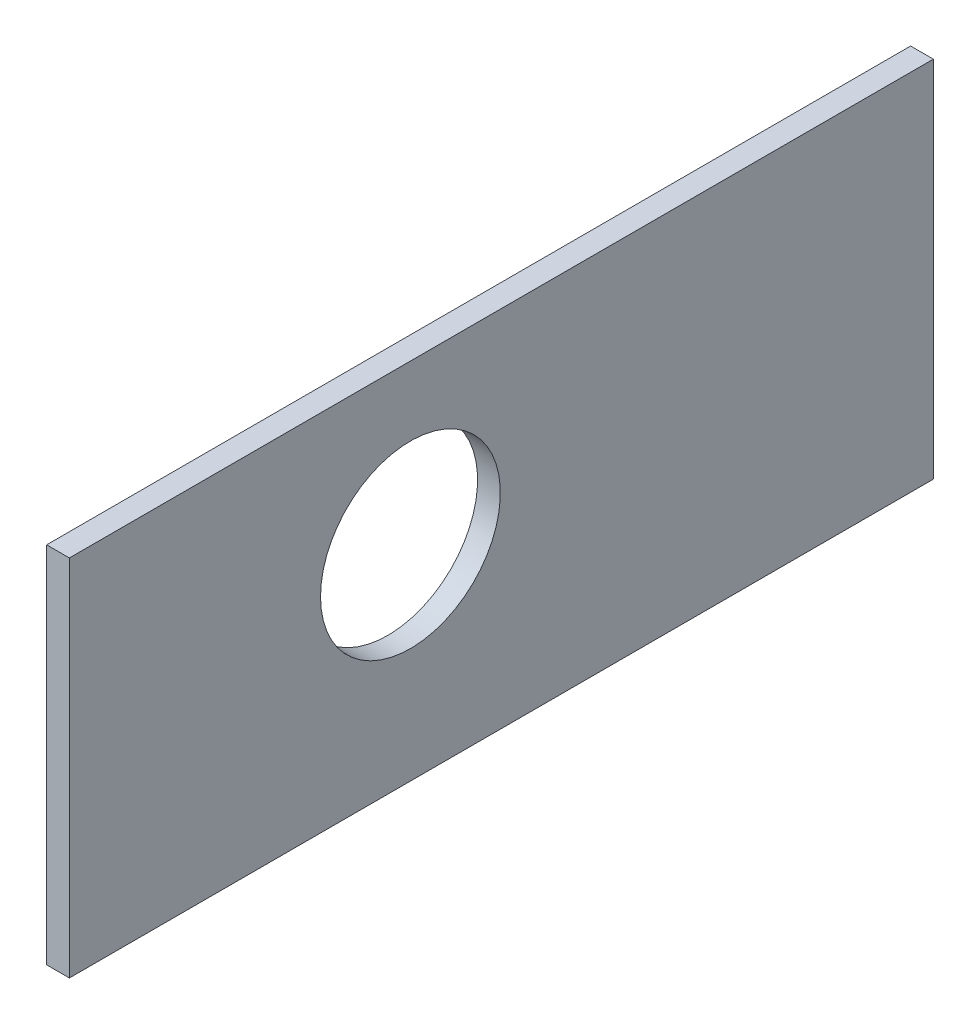
ISO-10303-21;
HEADER;
FILE_DESCRIPTION(('STEP AP214'),'2;1');
FILE_NAME('part.step','',(''),(''),'','','');
FILE_SCHEMA(('AUTOMOTIVE_DESIGN { 1 0 10303 214 1 1 1 1 }'));
ENDSEC;
DATA;
#1=APPLICATION_CONTEXT('core data for automotive mechanical design processes');
#2=APPLICATION_PROTOCOL_DEFINITION('international standard','automotive_design',2000,#1);
#3=PRODUCT_CONTEXT('',#1,'mechanical');
#4=PRODUCT('Part','Part','',(#3));
#5=PRODUCT_RELATED_PRODUCT_CATEGORY('part','',(#4));
#6=PRODUCT_DEFINITION_FORMATION('','',#4);
#7=PRODUCT_DEFINITION_CONTEXT('part definition',#1,'design');
#8=PRODUCT_DEFINITION('design','',#6,#7);
#9=PRODUCT_DEFINITION_SHAPE('','',#8);
#10=(LENGTH_UNIT() NAMED_UNIT(*) SI_UNIT(.MILLI.,.METRE.));
#11=(NAMED_UNIT(*) PLANE_ANGLE_UNIT() SI_UNIT($,.RADIAN.));
#12=(NAMED_UNIT(*) SI_UNIT($,.STERADIAN.) SOLID_ANGLE_UNIT());
#13=UNCERTAINTY_MEASURE_WITH_UNIT(LENGTH_MEASURE(1.E-05),#10,'distance_accuracy_value','');
#14=(GEOMETRIC_REPRESENTATION_CONTEXT(3) GLOBAL_UNCERTAINTY_ASSIGNED_CONTEXT((#13)) GLOBAL_UNIT_ASSIGNED_CONTEXT((#10,
#11,#12)) REPRESENTATION_CONTEXT('',''));
#15=CARTESIAN_POINT('',(0.,0.,0.));
#16=DIRECTION('',(0.,0.,1.));
#17=DIRECTION('',(1.,0.,0.));
#18=AXIS2_PLACEMENT_3D('',#15,#16,#17);
#19=CARTESIAN_POINT('',(-101.6,50.8,60.325));
#20=DIRECTION('',(1.,0.,0.));
#21=DIRECTION('',(0.,0.,-1.));
#22=AXIS2_PLACEMENT_3D('',#19,#20,#21);
#23=PLANE('',#22);
#24=CARTESIAN_POINT('',(-101.6,28.575,12.7));
#25=DIRECTION('',(-1.,0.,0.));
#26=DIRECTION('',(0.,0.,1.));
#27=AXIS2_PLACEMENT_3D('',#24,#25,#26);
#28=CIRCLE('',#27,12.55395);
#29=CARTESIAN_POINT('',(-101.6,28.575,25.25395));
#30=VERTEX_POINT('',#29);
#31=EDGE_CURVE('E87',#30,#30,#28,.T.);
#32=ORIENTED_EDGE('',*,*,#31,.F.);
#33=EDGE_LOOP('',(#32));
#34=FACE_BOUND('',#33,.T.);
#35=DIRECTION('',(0.,-1.,0.));
#36=VECTOR('',#35,1.);
#37=CARTESIAN_POINT('',(-101.6,50.8,-60.325));
#38=LINE('',#37,#36);
#39=CARTESIAN_POINT('',(-101.6,50.8,-60.325));
#40=VERTEX_POINT('',#39);
#41=CARTESIAN_POINT('',(-101.6,0.,-60.325));
#42=VERTEX_POINT('',#41);
#43=EDGE_CURVE('E42',#40,#42,#38,.T.);
#44=ORIENTED_EDGE('',*,*,#43,.T.);
#45=DIRECTION('',(0.,0.,1.));
#46=VECTOR('',#45,1.);
#47=CARTESIAN_POINT('',(-101.6,0.,60.325));
#48=LINE('',#47,#46);
#49=CARTESIAN_POINT('',(-101.6,0.,60.325));
#50=VERTEX_POINT('',#49);
#51=EDGE_CURVE('E98',#42,#50,#48,.T.);
#52=ORIENTED_EDGE('',*,*,#51,.T.);
#53=DIRECTION('',(0.,-1.,0.));
#54=VECTOR('',#53,1.);
#55=CARTESIAN_POINT('',(-101.6,50.8,60.325));
#56=LINE('',#55,#54);
#57=CARTESIAN_POINT('',(-101.6,50.8,60.325));
#58=VERTEX_POINT('',#57);
#59=EDGE_CURVE('E11',#58,#50,#56,.T.);
#60=ORIENTED_EDGE('',*,*,#59,.F.);
#61=DIRECTION('',(0.,0.,1.));
#62=VECTOR('',#61,1.);
#63=CARTESIAN_POINT('',(-101.6,50.8,60.325));
#64=LINE('',#63,#62);
#65=EDGE_CURVE('E94',#40,#58,#64,.T.);
#66=ORIENTED_EDGE('',*,*,#65,.F.);
#67=EDGE_LOOP('',(#44,#52,#60,#66));
#68=FACE_BOUND('',#67,.T.);
#69=ADVANCED_FACE('F34',(#34,#68),#23,.F.);
#70=CARTESIAN_POINT('',(101.6,50.8,60.325));
#71=DIRECTION('',(0.,0.,-1.));
#72=DIRECTION('',(-1.,0.,0.));
#73=AXIS2_PLACEMENT_3D('',#70,#71,#72);
#74=PLANE('',#73);
#75=DIRECTION('',(1.,0.,0.));
#76=VECTOR('',#75,1.);
#77=CARTESIAN_POINT('',(101.6,0.,60.325));
#78=LINE('',#77,#76);
#79=CARTESIAN_POINT('',(-98.425,0.,60.325));
#80=VERTEX_POINT('',#79);
#81=EDGE_CURVE('E101',#50,#80,#78,.T.);
#82=ORIENTED_EDGE('',*,*,#81,.T.);
#83=DIRECTION('',(0.,1.,0.));
#84=VECTOR('',#83,1.);
#85=CARTESIAN_POINT('',(-98.425,0.,60.325));
#86=LINE('',#85,#84);
#87=CARTESIAN_POINT('',(-98.425,50.8,60.325));
#88=VERTEX_POINT('',#87);
#89=EDGE_CURVE('E88',#80,#88,#86,.T.);
#90=ORIENTED_EDGE('',*,*,#89,.T.);
#91=DIRECTION('',(1.,0.,0.));
#92=VECTOR('',#91,1.);
#93=CARTESIAN_POINT('',(101.6,50.8,60.325));
#94=LINE('',#93,#92);
#95=EDGE_CURVE('E79',#58,#88,#94,.T.);
#96=ORIENTED_EDGE('',*,*,#95,.F.);
#97=ORIENTED_EDGE('',*,*,#59,.T.);
#98=EDGE_LOOP('',(#82,#90,#96,#97));
#99=FACE_BOUND('',#98,.T.);
#100=ADVANCED_FACE('F110',(#99),#74,.F.);
#101=CARTESIAN_POINT('',(101.6,50.8,-60.325));
#102=DIRECTION('',(0.,0.,1.));
#103=DIRECTION('',(1.,0.,0.));
#104=AXIS2_PLACEMENT_3D('',#101,#102,#103);
#105=PLANE('',#104);
#106=DIRECTION('',(-1.,0.,0.));
#107=VECTOR('',#106,1.);
#108=CARTESIAN_POINT('',(101.6,50.8,-60.325));
#109=LINE('',#108,#107);
#110=CARTESIAN_POINT('',(-98.425,50.8,-60.325));
#111=VERTEX_POINT('',#110);
#112=EDGE_CURVE('E50',#111,#40,#109,.T.);
#113=ORIENTED_EDGE('',*,*,#112,.F.);
#114=DIRECTION('',(0.,1.,0.));
#115=VECTOR('',#114,1.);
#116=CARTESIAN_POINT('',(-98.425,0.,-60.325));
#117=LINE('',#116,#115);
#118=CARTESIAN_POINT('',(-98.425,0.,-60.325));
#119=VERTEX_POINT('',#118);
#120=EDGE_CURVE('E83',#119,#111,#117,.T.);
#121=ORIENTED_EDGE('',*,*,#120,.F.);
#122=DIRECTION('',(-1.,0.,0.));
#123=VECTOR('',#122,1.);
#124=CARTESIAN_POINT('',(101.6,0.,-60.325));
#125=LINE('',#124,#123);
#126=EDGE_CURVE('E103',#119,#42,#125,.T.);
#127=ORIENTED_EDGE('',*,*,#126,.T.);
#128=ORIENTED_EDGE('',*,*,#43,.F.);
#129=EDGE_LOOP('',(#113,#121,#127,#128));
#130=FACE_BOUND('',#129,.T.);
#131=ADVANCED_FACE('F90',(#130),#105,.F.);
#132=CARTESIAN_POINT('',(0.,50.8,0.));
#133=DIRECTION('',(0.,1.,0.));
#134=DIRECTION('',(0.,0.,1.));
#135=AXIS2_PLACEMENT_3D('',#132,#133,#134);
#136=PLANE('',#135);
#137=DIRECTION('',(0.,0.,1.));
#138=VECTOR('',#137,1.);
#139=CARTESIAN_POINT('',(-98.425,50.8,-57.15));
#140=LINE('',#139,#138);
#141=EDGE_CURVE('E77',#111,#88,#140,.T.);
#142=ORIENTED_EDGE('',*,*,#141,.F.);
#143=ORIENTED_EDGE('',*,*,#112,.T.);
#144=ORIENTED_EDGE('',*,*,#65,.T.);
#145=ORIENTED_EDGE('',*,*,#95,.T.);
#146=EDGE_LOOP('',(#142,#143,#144,#145));
#147=FACE_BOUND('',#146,.T.);
#148=ADVANCED_FACE('F78',(#147),#136,.T.);
#149=CARTESIAN_POINT('',(0.,0.,0.));
#150=DIRECTION('',(0.,1.,0.));
#151=DIRECTION('',(0.,0.,1.));
#152=AXIS2_PLACEMENT_3D('',#149,#150,#151);
#153=PLANE('',#152);
#154=ORIENTED_EDGE('',*,*,#126,.F.);
#155=DIRECTION('',(0.,0.,1.));
#156=VECTOR('',#155,1.);
#157=CARTESIAN_POINT('',(-98.425,0.,-57.15));
#158=LINE('',#157,#156);
#159=EDGE_CURVE('E69',#119,#80,#158,.T.);
#160=ORIENTED_EDGE('',*,*,#159,.T.);
#161=ORIENTED_EDGE('',*,*,#81,.F.);
#162=ORIENTED_EDGE('',*,*,#51,.F.);
#163=EDGE_LOOP('',(#154,#160,#161,#162));
#164=FACE_BOUND('',#163,.T.);
#165=ADVANCED_FACE('F113',(#164),#153,.F.);
#166=CARTESIAN_POINT('',(-98.425,0.,-57.15));
#167=DIRECTION('',(-1.,0.,0.));
#168=DIRECTION('',(0.,0.,1.));
#169=AXIS2_PLACEMENT_3D('',#166,#167,#168);
#170=PLANE('',#169);
#171=CARTESIAN_POINT('',(-98.425,28.575,12.7));
#172=DIRECTION('',(-1.,0.,0.));
#173=DIRECTION('',(0.,0.,1.));
#174=AXIS2_PLACEMENT_3D('',#171,#172,#173);
#175=CIRCLE('',#174,12.55395);
#176=CARTESIAN_POINT('',(-98.425,28.575,25.25395));
#177=VERTEX_POINT('',#176);
#178=EDGE_CURVE('E81',#177,#177,#175,.F.);
#179=ORIENTED_EDGE('',*,*,#178,.F.);
#180=EDGE_LOOP('',(#179));
#181=FACE_BOUND('',#180,.T.);
#182=ORIENTED_EDGE('',*,*,#141,.T.);
#183=ORIENTED_EDGE('',*,*,#89,.F.);
#184=ORIENTED_EDGE('',*,*,#159,.F.);
#185=ORIENTED_EDGE('',*,*,#120,.T.);
#186=EDGE_LOOP('',(#182,#183,#184,#185));
#187=FACE_BOUND('',#186,.T.);
#188=ADVANCED_FACE('F84',(#181,#187),#170,.F.);
#189=CARTESIAN_POINT('',(101.601,28.575,12.7));
#190=DIRECTION('',(-1.,0.,0.));
#191=DIRECTION('',(0.,0.,1.));
#192=AXIS2_PLACEMENT_3D('',#189,#190,#191);
#193=CYLINDRICAL_SURFACE('',#192,12.55395);
#194=ORIENTED_EDGE('',*,*,#31,.T.);
#195=EDGE_LOOP('',(#194));
#196=FACE_BOUND('',#195,.T.);
#197=ORIENTED_EDGE('',*,*,#178,.T.);
#198=EDGE_LOOP('',(#197));
#199=FACE_BOUND('',#198,.T.);
#200=ADVANCED_FACE('F122',(#196,#199),#193,.F.);
#201=CLOSED_SHELL('',(#69,#100,#131,#148,#165,#188,#200));
#202=MANIFOLD_SOLID_BREP('B2',#201);
#203=ADVANCED_BREP_SHAPE_REPRESENTATION('',(#18,#202),#14);
#204=SHAPE_DEFINITION_REPRESENTATION(#9,#203);
ENDSEC;
END-ISO-10303-21;
